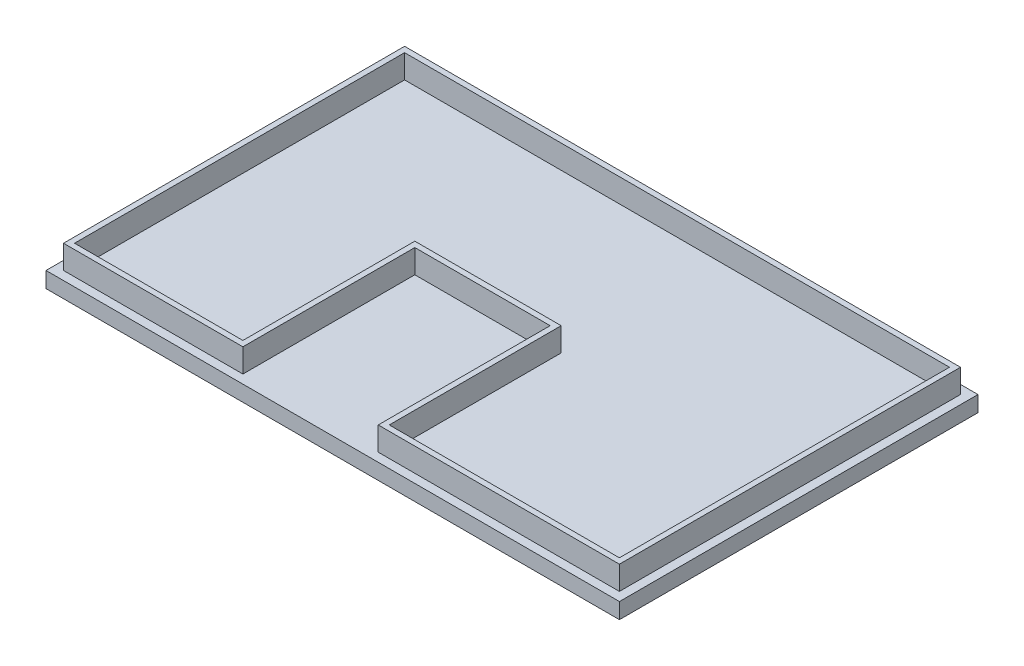
ISO-10303-21;
HEADER;
FILE_DESCRIPTION(('STEP AP214'),'2;1');
FILE_NAME('part.step','',(''),(''),'','','');
FILE_SCHEMA(('AUTOMOTIVE_DESIGN { 1 0 10303 214 1 1 1 1 }'));
ENDSEC;
DATA;
#1=APPLICATION_CONTEXT('core data for automotive mechanical design processes');
#2=APPLICATION_PROTOCOL_DEFINITION('international standard','automotive_design',2000,#1);
#3=PRODUCT_CONTEXT('',#1,'mechanical');
#4=PRODUCT('Part','Part','',(#3));
#5=PRODUCT_RELATED_PRODUCT_CATEGORY('part','',(#4));
#6=PRODUCT_DEFINITION_FORMATION('','',#4);
#7=PRODUCT_DEFINITION_CONTEXT('part definition',#1,'design');
#8=PRODUCT_DEFINITION('design','',#6,#7);
#9=PRODUCT_DEFINITION_SHAPE('','',#8);
#10=(LENGTH_UNIT() NAMED_UNIT(*) SI_UNIT(.MILLI.,.METRE.));
#11=(NAMED_UNIT(*) PLANE_ANGLE_UNIT() SI_UNIT($,.RADIAN.));
#12=(NAMED_UNIT(*) SI_UNIT($,.STERADIAN.) SOLID_ANGLE_UNIT());
#13=UNCERTAINTY_MEASURE_WITH_UNIT(LENGTH_MEASURE(1.E-05),#10,'distance_accuracy_value','');
#14=(GEOMETRIC_REPRESENTATION_CONTEXT(3) GLOBAL_UNCERTAINTY_ASSIGNED_CONTEXT((#13)) GLOBAL_UNIT_ASSIGNED_CONTEXT((#10,
#11,#12)) REPRESENTATION_CONTEXT('',''));
#15=CARTESIAN_POINT('',(0.,0.,0.));
#16=DIRECTION('',(0.,0.,1.));
#17=DIRECTION('',(1.,0.,0.));
#18=AXIS2_PLACEMENT_3D('',#15,#16,#17);
#19=CARTESIAN_POINT('',(0.,5.08,0.));
#20=DIRECTION('',(0.,1.,0.));
#21=DIRECTION('',(0.,0.,1.));
#22=AXIS2_PLACEMENT_3D('',#19,#20,#21);
#23=PLANE('',#22);
#24=DIRECTION('',(1.,0.,0.));
#25=VECTOR('',#24,1.);
#26=CARTESIAN_POINT('',(0.,5.08,0.));
#27=LINE('',#26,#25);
#28=CARTESIAN_POINT('',(0.,5.08,0.));
#29=VERTEX_POINT('',#28);
#30=CARTESIAN_POINT('',(185.1152,5.08,0.));
#31=VERTEX_POINT('',#30);
#32=EDGE_CURVE('E349',#29,#31,#27,.T.);
#33=ORIENTED_EDGE('',*,*,#32,.T.);
#34=DIRECTION('',(0.,0.,-1.));
#35=VECTOR('',#34,1.);
#36=CARTESIAN_POINT('',(185.1152,5.08,0.));
#37=LINE('',#36,#35);
#38=CARTESIAN_POINT('',(185.1152,5.08,-115.7478));
#39=VERTEX_POINT('',#38);
#40=EDGE_CURVE('E352',#31,#39,#37,.T.);
#41=ORIENTED_EDGE('',*,*,#40,.T.);
#42=DIRECTION('',(1.,0.,0.));
#43=VECTOR('',#42,1.);
#44=CARTESIAN_POINT('',(0.,5.08,-115.7478));
#45=LINE('',#44,#43);
#46=CARTESIAN_POINT('',(0.,5.08,-115.7478));
#47=VERTEX_POINT('',#46);
#48=EDGE_CURVE('E355',#47,#39,#45,.T.);
#49=ORIENTED_EDGE('',*,*,#48,.F.);
#50=DIRECTION('',(0.,0.,-1.));
#51=VECTOR('',#50,1.);
#52=CARTESIAN_POINT('',(0.,5.08,0.));
#53=LINE('',#52,#51);
#54=EDGE_CURVE('E358',#29,#47,#53,.T.);
#55=ORIENTED_EDGE('',*,*,#54,.F.);
#56=EDGE_LOOP('',(#33,#41,#49,#55));
#57=FACE_BOUND('',#56,.T.);
#58=DIRECTION('',(-1.,0.,0.));
#59=VECTOR('',#58,1.);
#60=CARTESIAN_POINT('',(60.7441,5.08,-2.8194));
#61=LINE('',#60,#59);
#62=CARTESIAN_POINT('',(60.7441,5.08,-2.8194));
#63=VERTEX_POINT('',#62);
#64=CARTESIAN_POINT('',(2.83209999999999,5.08,-2.81940000000001));
#65=VERTEX_POINT('',#64);
#66=EDGE_CURVE('E96',#63,#65,#61,.T.);
#67=ORIENTED_EDGE('',*,*,#66,.T.);
#68=DIRECTION('',(0.,0.,1.));
#69=VECTOR('',#68,1.);
#70=CARTESIAN_POINT('',(2.83209999999999,5.08,-112.9284));
#71=LINE('',#70,#69);
#72=CARTESIAN_POINT('',(2.83209999999999,5.08,-112.9284));
#73=VERTEX_POINT('',#72);
#74=EDGE_CURVE('E237',#73,#65,#71,.T.);
#75=ORIENTED_EDGE('',*,*,#74,.F.);
#76=DIRECTION('',(1.,0.,0.));
#77=VECTOR('',#76,1.);
#78=CARTESIAN_POINT('',(2.83209999999999,5.08,-112.9284));
#79=LINE('',#78,#77);
#80=CARTESIAN_POINT('',(182.2831,5.08,-112.9284));
#81=VERTEX_POINT('',#80);
#82=EDGE_CURVE('E292',#73,#81,#79,.T.);
#83=ORIENTED_EDGE('',*,*,#82,.T.);
#84=DIRECTION('',(0.,0.,1.));
#85=VECTOR('',#84,1.);
#86=CARTESIAN_POINT('',(182.2831,5.08,-112.9284));
#87=LINE('',#86,#85);
#88=CARTESIAN_POINT('',(182.2831,5.08,-2.81940000000004));
#89=VERTEX_POINT('',#88);
#90=EDGE_CURVE('E324',#81,#89,#87,.T.);
#91=ORIENTED_EDGE('',*,*,#90,.T.);
#92=DIRECTION('',(1.,0.,0.));
#93=VECTOR('',#92,1.);
#94=CARTESIAN_POINT('',(104.4321,5.08,-2.81940000000004));
#95=LINE('',#94,#93);
#96=CARTESIAN_POINT('',(104.4321,5.08,-2.81940000000004));
#97=VERTEX_POINT('',#96);
#98=EDGE_CURVE('E321',#97,#89,#95,.T.);
#99=ORIENTED_EDGE('',*,*,#98,.F.);
#100=DIRECTION('',(0.,0.,1.));
#101=VECTOR('',#100,1.);
#102=CARTESIAN_POINT('',(104.4321,5.08,-58.3184));
#103=LINE('',#102,#101);
#104=CARTESIAN_POINT('',(104.4321,5.08,-58.3184));
#105=VERTEX_POINT('',#104);
#106=EDGE_CURVE('E318',#105,#97,#103,.T.);
#107=ORIENTED_EDGE('',*,*,#106,.F.);
#108=DIRECTION('',(1.,0.,0.));
#109=VECTOR('',#108,1.);
#110=CARTESIAN_POINT('',(60.7441,5.08,-58.3184));
#111=LINE('',#110,#109);
#112=CARTESIAN_POINT('',(60.7441,5.08,-58.3184));
#113=VERTEX_POINT('',#112);
#114=EDGE_CURVE('E315',#113,#105,#111,.T.);
#115=ORIENTED_EDGE('',*,*,#114,.F.);
#116=DIRECTION('',(0.,0.,1.));
#117=VECTOR('',#116,1.);
#118=CARTESIAN_POINT('',(60.7441,5.08,-58.3184));
#119=LINE('',#118,#117);
#120=EDGE_CURVE('E101',#113,#63,#119,.T.);
#121=ORIENTED_EDGE('',*,*,#120,.T.);
#122=EDGE_LOOP('',(#67,#75,#83,#91,#99,#107,#115,#121));
#123=FACE_BOUND('',#122,.T.);
#124=ADVANCED_FACE('F81',(#57,#123),#23,.T.);
#125=CARTESIAN_POINT('',(0.,5.08,0.));
#126=DIRECTION('',(0.,0.,-1.));
#127=DIRECTION('',(-1.,0.,0.));
#128=AXIS2_PLACEMENT_3D('',#125,#126,#127);
#129=PLANE('',#128);
#130=DIRECTION('',(1.,0.,0.));
#131=VECTOR('',#130,1.);
#132=CARTESIAN_POINT('',(0.,0.,0.));
#133=LINE('',#132,#131);
#134=CARTESIAN_POINT('',(0.,0.,0.));
#135=VERTEX_POINT('',#134);
#136=CARTESIAN_POINT('',(185.1152,0.,0.));
#137=VERTEX_POINT('',#136);
#138=EDGE_CURVE('E348',#135,#137,#133,.T.);
#139=ORIENTED_EDGE('',*,*,#138,.T.);
#140=DIRECTION('',(0.,-1.,0.));
#141=VECTOR('',#140,1.);
#142=CARTESIAN_POINT('',(185.1152,5.08,0.));
#143=LINE('',#142,#141);
#144=EDGE_CURVE('E12',#31,#137,#143,.T.);
#145=ORIENTED_EDGE('',*,*,#144,.F.);
#146=ORIENTED_EDGE('',*,*,#32,.F.);
#147=DIRECTION('',(0.,-1.,0.));
#148=VECTOR('',#147,1.);
#149=CARTESIAN_POINT('',(0.,5.08,0.));
#150=LINE('',#149,#148);
#151=EDGE_CURVE('E361',#29,#135,#150,.T.);
#152=ORIENTED_EDGE('',*,*,#151,.T.);
#153=EDGE_LOOP('',(#139,#145,#146,#152));
#154=FACE_BOUND('',#153,.T.);
#155=ADVANCED_FACE('F83',(#154),#129,.F.);
#156=CARTESIAN_POINT('',(185.1152,5.08,0.));
#157=DIRECTION('',(-1.,0.,0.));
#158=DIRECTION('',(0.,0.,1.));
#159=AXIS2_PLACEMENT_3D('',#156,#157,#158);
#160=PLANE('',#159);
#161=DIRECTION('',(0.,0.,-1.));
#162=VECTOR('',#161,1.);
#163=CARTESIAN_POINT('',(185.1152,0.,0.));
#164=LINE('',#163,#162);
#165=CARTESIAN_POINT('',(185.1152,0.,-115.7478));
#166=VERTEX_POINT('',#165);
#167=EDGE_CURVE('E364',#137,#166,#164,.T.);
#168=ORIENTED_EDGE('',*,*,#167,.T.);
#169=DIRECTION('',(0.,-1.,0.));
#170=VECTOR('',#169,1.);
#171=CARTESIAN_POINT('',(185.1152,5.08,-115.7478));
#172=LINE('',#171,#170);
#173=EDGE_CURVE('E89',#39,#166,#172,.T.);
#174=ORIENTED_EDGE('',*,*,#173,.F.);
#175=ORIENTED_EDGE('',*,*,#40,.F.);
#176=ORIENTED_EDGE('',*,*,#144,.T.);
#177=EDGE_LOOP('',(#168,#174,#175,#176));
#178=FACE_BOUND('',#177,.T.);
#179=ADVANCED_FACE('F380',(#178),#160,.F.);
#180=CARTESIAN_POINT('',(0.,5.08,-115.7478));
#181=DIRECTION('',(0.,0.,-1.));
#182=DIRECTION('',(-1.,0.,0.));
#183=AXIS2_PLACEMENT_3D('',#180,#181,#182);
#184=PLANE('',#183);
#185=DIRECTION('',(1.,0.,0.));
#186=VECTOR('',#185,1.);
#187=CARTESIAN_POINT('',(0.,0.,-115.7478));
#188=LINE('',#187,#186);
#189=CARTESIAN_POINT('',(0.,0.,-115.7478));
#190=VERTEX_POINT('',#189);
#191=EDGE_CURVE('E367',#190,#166,#188,.T.);
#192=ORIENTED_EDGE('',*,*,#191,.F.);
#193=DIRECTION('',(0.,-1.,0.));
#194=VECTOR('',#193,1.);
#195=CARTESIAN_POINT('',(0.,5.08,-115.7478));
#196=LINE('',#195,#194);
#197=EDGE_CURVE('E373',#47,#190,#196,.T.);
#198=ORIENTED_EDGE('',*,*,#197,.F.);
#199=ORIENTED_EDGE('',*,*,#48,.T.);
#200=ORIENTED_EDGE('',*,*,#173,.T.);
#201=EDGE_LOOP('',(#192,#198,#199,#200));
#202=FACE_BOUND('',#201,.T.);
#203=ADVANCED_FACE('F377',(#202),#184,.T.);
#204=CARTESIAN_POINT('',(0.,5.08,0.));
#205=DIRECTION('',(-1.,0.,0.));
#206=DIRECTION('',(0.,0.,1.));
#207=AXIS2_PLACEMENT_3D('',#204,#205,#206);
#208=PLANE('',#207);
#209=DIRECTION('',(0.,0.,-1.));
#210=VECTOR('',#209,1.);
#211=CARTESIAN_POINT('',(0.,0.,0.));
#212=LINE('',#211,#210);
#213=EDGE_CURVE('E353',#135,#190,#212,.T.);
#214=ORIENTED_EDGE('',*,*,#213,.F.);
#215=ORIENTED_EDGE('',*,*,#151,.F.);
#216=ORIENTED_EDGE('',*,*,#54,.T.);
#217=ORIENTED_EDGE('',*,*,#197,.T.);
#218=EDGE_LOOP('',(#214,#215,#216,#217));
#219=FACE_BOUND('',#218,.T.);
#220=ADVANCED_FACE('F387',(#219),#208,.T.);
#221=CARTESIAN_POINT('',(0.,0.,0.));
#222=DIRECTION('',(0.,1.,0.));
#223=DIRECTION('',(0.,0.,1.));
#224=AXIS2_PLACEMENT_3D('',#221,#222,#223);
#225=PLANE('',#224);
#226=ORIENTED_EDGE('',*,*,#138,.F.);
#227=ORIENTED_EDGE('',*,*,#213,.T.);
#228=ORIENTED_EDGE('',*,*,#191,.T.);
#229=ORIENTED_EDGE('',*,*,#167,.F.);
#230=EDGE_LOOP('',(#226,#227,#228,#229));
#231=FACE_BOUND('',#230,.T.);
#232=ADVANCED_FACE('F384',(#231),#225,.F.);
#233=CARTESIAN_POINT('',(0.,12.7,0.));
#234=DIRECTION('',(0.,-1.,0.));
#235=DIRECTION('',(0.,0.,-1.));
#236=AXIS2_PLACEMENT_3D('',#233,#234,#235);
#237=PLANE('',#236);
#238=DIRECTION('',(0.,0.,1.));
#239=VECTOR('',#238,1.);
#240=CARTESIAN_POINT('',(2.83209999999999,12.7,-112.9284));
#241=LINE('',#240,#239);
#242=CARTESIAN_POINT('',(2.83209999999999,12.7,-112.9284));
#243=VERTEX_POINT('',#242);
#244=CARTESIAN_POINT('',(2.83209999999999,12.7,-2.81940000000001));
#245=VERTEX_POINT('',#244);
#246=EDGE_CURVE('E289',#243,#245,#241,.T.);
#247=ORIENTED_EDGE('',*,*,#246,.T.);
#248=DIRECTION('',(-1.,0.,0.));
#249=VECTOR('',#248,1.);
#250=CARTESIAN_POINT('',(60.7441,12.7,-2.8194));
#251=LINE('',#250,#249);
#252=CARTESIAN_POINT('',(60.7441,12.7,-2.8194));
#253=VERTEX_POINT('',#252);
#254=EDGE_CURVE('E291',#253,#245,#251,.T.);
#255=ORIENTED_EDGE('',*,*,#254,.F.);
#256=DIRECTION('',(0.,0.,1.));
#257=VECTOR('',#256,1.);
#258=CARTESIAN_POINT('',(60.7441,12.7,-58.3184));
#259=LINE('',#258,#257);
#260=CARTESIAN_POINT('',(60.7441,12.7,-58.3184));
#261=VERTEX_POINT('',#260);
#262=EDGE_CURVE('E295',#261,#253,#259,.T.);
#263=ORIENTED_EDGE('',*,*,#262,.F.);
#264=DIRECTION('',(1.,0.,0.));
#265=VECTOR('',#264,1.);
#266=CARTESIAN_POINT('',(60.7441,12.7,-58.3184));
#267=LINE('',#266,#265);
#268=CARTESIAN_POINT('',(104.4321,12.7,-58.3184));
#269=VERTEX_POINT('',#268);
#270=EDGE_CURVE('E298',#261,#269,#267,.T.);
#271=ORIENTED_EDGE('',*,*,#270,.T.);
#272=DIRECTION('',(0.,0.,1.));
#273=VECTOR('',#272,1.);
#274=CARTESIAN_POINT('',(104.4321,12.7,-58.3184));
#275=LINE('',#274,#273);
#276=CARTESIAN_POINT('',(104.4321,12.7,-2.81940000000004));
#277=VERTEX_POINT('',#276);
#278=EDGE_CURVE('E300',#269,#277,#275,.T.);
#279=ORIENTED_EDGE('',*,*,#278,.T.);
#280=DIRECTION('',(1.,0.,0.));
#281=VECTOR('',#280,1.);
#282=CARTESIAN_POINT('',(104.4321,12.7,-2.81940000000004));
#283=LINE('',#282,#281);
#284=CARTESIAN_POINT('',(182.2831,12.7,-2.81940000000004));
#285=VERTEX_POINT('',#284);
#286=EDGE_CURVE('E302',#277,#285,#283,.T.);
#287=ORIENTED_EDGE('',*,*,#286,.T.);
#288=DIRECTION('',(0.,0.,1.));
#289=VECTOR('',#288,1.);
#290=CARTESIAN_POINT('',(182.2831,12.7,-112.9284));
#291=LINE('',#290,#289);
#292=CARTESIAN_POINT('',(182.2831,12.7,-112.9284));
#293=VERTEX_POINT('',#292);
#294=EDGE_CURVE('E304',#293,#285,#291,.T.);
#295=ORIENTED_EDGE('',*,*,#294,.F.);
#296=DIRECTION('',(1.,0.,0.));
#297=VECTOR('',#296,1.);
#298=CARTESIAN_POINT('',(2.83209999999999,12.7,-112.9284));
#299=LINE('',#298,#297);
#300=EDGE_CURVE('E307',#243,#293,#299,.T.);
#301=ORIENTED_EDGE('',*,*,#300,.F.);
#302=EDGE_LOOP('',(#247,#255,#263,#271,#279,#287,#295,#301));
#303=FACE_BOUND('',#302,.T.);
#304=DIRECTION('',(-1.,0.,0.));
#305=VECTOR('',#304,1.);
#306=CARTESIAN_POINT('',(180.5051,12.7,-111.1504));
#307=LINE('',#306,#305);
#308=CARTESIAN_POINT('',(180.5051,12.7,-111.1504));
#309=VERTEX_POINT('',#308);
#310=CARTESIAN_POINT('',(4.61009999999998,12.7,-111.1504));
#311=VERTEX_POINT('',#310);
#312=EDGE_CURVE('E218',#309,#311,#307,.T.);
#313=ORIENTED_EDGE('',*,*,#312,.F.);
#314=DIRECTION('',(0.,0.,-1.));
#315=VECTOR('',#314,1.);
#316=CARTESIAN_POINT('',(180.5051,12.7,-4.59740000000004));
#317=LINE('',#316,#315);
#318=CARTESIAN_POINT('',(180.5051,12.7,-4.59740000000004));
#319=VERTEX_POINT('',#318);
#320=EDGE_CURVE('E256',#319,#309,#317,.T.);
#321=ORIENTED_EDGE('',*,*,#320,.F.);
#322=DIRECTION('',(1.,0.,0.));
#323=VECTOR('',#322,1.);
#324=CARTESIAN_POINT('',(106.2101,12.7,-4.59740000000004));
#325=LINE('',#324,#323);
#326=CARTESIAN_POINT('',(106.2101,12.7,-4.59740000000004));
#327=VERTEX_POINT('',#326);
#328=EDGE_CURVE('E253',#327,#319,#325,.T.);
#329=ORIENTED_EDGE('',*,*,#328,.F.);
#330=DIRECTION('',(0.,0.,1.));
#331=VECTOR('',#330,1.);
#332=CARTESIAN_POINT('',(106.2101,12.7,-60.0964));
#333=LINE('',#332,#331);
#334=CARTESIAN_POINT('',(106.2101,12.7,-60.0964));
#335=VERTEX_POINT('',#334);
#336=EDGE_CURVE('E251',#335,#327,#333,.T.);
#337=ORIENTED_EDGE('',*,*,#336,.F.);
#338=DIRECTION('',(1.,0.,0.));
#339=VECTOR('',#338,1.);
#340=CARTESIAN_POINT('',(58.9661,12.7,-60.0964));
#341=LINE('',#340,#339);
#342=CARTESIAN_POINT('',(58.9661,12.7,-60.0964));
#343=VERTEX_POINT('',#342);
#344=EDGE_CURVE('E249',#343,#335,#341,.T.);
#345=ORIENTED_EDGE('',*,*,#344,.F.);
#346=DIRECTION('',(0.,0.,-1.));
#347=VECTOR('',#346,1.);
#348=CARTESIAN_POINT('',(58.9661,12.7,-4.59739999999999));
#349=LINE('',#348,#347);
#350=CARTESIAN_POINT('',(58.9661,12.7,-4.59739999999999));
#351=VERTEX_POINT('',#350);
#352=EDGE_CURVE('E245',#351,#343,#349,.T.);
#353=ORIENTED_EDGE('',*,*,#352,.F.);
#354=DIRECTION('',(1.,0.,0.));
#355=VECTOR('',#354,1.);
#356=CARTESIAN_POINT('',(4.61009999999999,12.7,-4.59739999999999));
#357=LINE('',#356,#355);
#358=CARTESIAN_POINT('',(4.61009999999999,12.7,-4.59739999999999));
#359=VERTEX_POINT('',#358);
#360=EDGE_CURVE('E243',#359,#351,#357,.T.);
#361=ORIENTED_EDGE('',*,*,#360,.F.);
#362=DIRECTION('',(0.,0.,1.));
#363=VECTOR('',#362,1.);
#364=CARTESIAN_POINT('',(4.61009999999998,12.7,-111.1504));
#365=LINE('',#364,#363);
#366=EDGE_CURVE('E228',#311,#359,#365,.T.);
#367=ORIENTED_EDGE('',*,*,#366,.F.);
#368=EDGE_LOOP('',(#313,#321,#329,#337,#345,#353,#361,#367));
#369=FACE_BOUND('',#368,.T.);
#370=ADVANCED_FACE('F241',(#303,#369),#237,.F.);
#371=CARTESIAN_POINT('',(2.83209999999999,12.7,-112.9284));
#372=DIRECTION('',(1.,0.,0.));
#373=DIRECTION('',(0.,0.,-1.));
#374=AXIS2_PLACEMENT_3D('',#371,#372,#373);
#375=PLANE('',#374);
#376=ORIENTED_EDGE('',*,*,#74,.T.);
#377=DIRECTION('',(0.,-1.,0.));
#378=VECTOR('',#377,1.);
#379=CARTESIAN_POINT('',(2.83209999999999,12.7,-2.81940000000001));
#380=LINE('',#379,#378);
#381=EDGE_CURVE('E346',#245,#65,#380,.T.);
#382=ORIENTED_EDGE('',*,*,#381,.F.);
#383=ORIENTED_EDGE('',*,*,#246,.F.);
#384=DIRECTION('',(0.,-1.,0.));
#385=VECTOR('',#384,1.);
#386=CARTESIAN_POINT('',(2.83209999999999,12.7,-112.9284));
#387=LINE('',#386,#385);
#388=EDGE_CURVE('E310',#243,#73,#387,.T.);
#389=ORIENTED_EDGE('',*,*,#388,.T.);
#390=EDGE_LOOP('',(#376,#382,#383,#389));
#391=FACE_BOUND('',#390,.T.);
#392=ADVANCED_FACE('F449',(#391),#375,.F.);
#393=CARTESIAN_POINT('',(60.7441,12.7,-2.8194));
#394=DIRECTION('',(0.,0.,1.));
#395=DIRECTION('',(1.,0.,0.));
#396=AXIS2_PLACEMENT_3D('',#393,#394,#395);
#397=PLANE('',#396);
#398=ORIENTED_EDGE('',*,*,#66,.F.);
#399=DIRECTION('',(0.,-1.,0.));
#400=VECTOR('',#399,1.);
#401=CARTESIAN_POINT('',(60.7441,12.7,-2.8194));
#402=LINE('',#401,#400);
#403=EDGE_CURVE('E344',#253,#63,#402,.T.);
#404=ORIENTED_EDGE('',*,*,#403,.F.);
#405=ORIENTED_EDGE('',*,*,#254,.T.);
#406=ORIENTED_EDGE('',*,*,#381,.T.);
#407=EDGE_LOOP('',(#398,#404,#405,#406));
#408=FACE_BOUND('',#407,.T.);
#409=ADVANCED_FACE('F473',(#408),#397,.T.);
#410=CARTESIAN_POINT('',(60.7441,12.7,-58.3184));
#411=DIRECTION('',(1.,0.,0.));
#412=DIRECTION('',(0.,0.,-1.));
#413=AXIS2_PLACEMENT_3D('',#410,#411,#412);
#414=PLANE('',#413);
#415=ORIENTED_EDGE('',*,*,#120,.F.);
#416=DIRECTION('',(0.,-1.,0.));
#417=VECTOR('',#416,1.);
#418=CARTESIAN_POINT('',(60.7441,12.7,-58.3184));
#419=LINE('',#418,#417);
#420=EDGE_CURVE('E341',#261,#113,#419,.T.);
#421=ORIENTED_EDGE('',*,*,#420,.F.);
#422=ORIENTED_EDGE('',*,*,#262,.T.);
#423=ORIENTED_EDGE('',*,*,#403,.T.);
#424=EDGE_LOOP('',(#415,#421,#422,#423));
#425=FACE_BOUND('',#424,.T.);
#426=ADVANCED_FACE('F469',(#425),#414,.T.);
#427=CARTESIAN_POINT('',(60.7441,12.7,-58.3184));
#428=DIRECTION('',(0.,0.,-1.));
#429=DIRECTION('',(-1.,0.,0.));
#430=AXIS2_PLACEMENT_3D('',#427,#428,#429);
#431=PLANE('',#430);
#432=ORIENTED_EDGE('',*,*,#114,.T.);
#433=DIRECTION('',(0.,-1.,0.));
#434=VECTOR('',#433,1.);
#435=CARTESIAN_POINT('',(104.4321,12.7,-58.3184));
#436=LINE('',#435,#434);
#437=EDGE_CURVE('E338',#269,#105,#436,.T.);
#438=ORIENTED_EDGE('',*,*,#437,.F.);
#439=ORIENTED_EDGE('',*,*,#270,.F.);
#440=ORIENTED_EDGE('',*,*,#420,.T.);
#441=EDGE_LOOP('',(#432,#438,#439,#440));
#442=FACE_BOUND('',#441,.T.);
#443=ADVANCED_FACE('F465',(#442),#431,.F.);
#444=CARTESIAN_POINT('',(104.4321,12.7,-58.3184));
#445=DIRECTION('',(1.,0.,0.));
#446=DIRECTION('',(0.,0.,-1.));
#447=AXIS2_PLACEMENT_3D('',#444,#445,#446);
#448=PLANE('',#447);
#449=ORIENTED_EDGE('',*,*,#106,.T.);
#450=DIRECTION('',(0.,-1.,0.));
#451=VECTOR('',#450,1.);
#452=CARTESIAN_POINT('',(104.4321,12.7,-2.81940000000004));
#453=LINE('',#452,#451);
#454=EDGE_CURVE('E335',#277,#97,#453,.T.);
#455=ORIENTED_EDGE('',*,*,#454,.F.);
#456=ORIENTED_EDGE('',*,*,#278,.F.);
#457=ORIENTED_EDGE('',*,*,#437,.T.);
#458=EDGE_LOOP('',(#449,#455,#456,#457));
#459=FACE_BOUND('',#458,.T.);
#460=ADVANCED_FACE('F461',(#459),#448,.F.);
#461=CARTESIAN_POINT('',(104.4321,12.7,-2.81940000000004));
#462=DIRECTION('',(0.,0.,-1.));
#463=DIRECTION('',(-1.,0.,0.));
#464=AXIS2_PLACEMENT_3D('',#461,#462,#463);
#465=PLANE('',#464);
#466=ORIENTED_EDGE('',*,*,#98,.T.);
#467=DIRECTION('',(0.,-1.,0.));
#468=VECTOR('',#467,1.);
#469=CARTESIAN_POINT('',(182.2831,12.7,-2.81940000000004));
#470=LINE('',#469,#468);
#471=EDGE_CURVE('E332',#285,#89,#470,.T.);
#472=ORIENTED_EDGE('',*,*,#471,.F.);
#473=ORIENTED_EDGE('',*,*,#286,.F.);
#474=ORIENTED_EDGE('',*,*,#454,.T.);
#475=EDGE_LOOP('',(#466,#472,#473,#474));
#476=FACE_BOUND('',#475,.T.);
#477=ADVANCED_FACE('F457',(#476),#465,.F.);
#478=CARTESIAN_POINT('',(182.2831,12.7,-112.9284));
#479=DIRECTION('',(1.,0.,0.));
#480=DIRECTION('',(0.,0.,-1.));
#481=AXIS2_PLACEMENT_3D('',#478,#479,#480);
#482=PLANE('',#481);
#483=ORIENTED_EDGE('',*,*,#90,.F.);
#484=DIRECTION('',(0.,-1.,0.));
#485=VECTOR('',#484,1.);
#486=CARTESIAN_POINT('',(182.2831,12.7,-112.9284));
#487=LINE('',#486,#485);
#488=EDGE_CURVE('E329',#293,#81,#487,.T.);
#489=ORIENTED_EDGE('',*,*,#488,.F.);
#490=ORIENTED_EDGE('',*,*,#294,.T.);
#491=ORIENTED_EDGE('',*,*,#471,.T.);
#492=EDGE_LOOP('',(#483,#489,#490,#491));
#493=FACE_BOUND('',#492,.T.);
#494=ADVANCED_FACE('F453',(#493),#482,.T.);
#495=CARTESIAN_POINT('',(2.83209999999999,12.7,-112.9284));
#496=DIRECTION('',(0.,0.,-1.));
#497=DIRECTION('',(-1.,0.,0.));
#498=AXIS2_PLACEMENT_3D('',#495,#496,#497);
#499=PLANE('',#498);
#500=ORIENTED_EDGE('',*,*,#82,.F.);
#501=ORIENTED_EDGE('',*,*,#388,.F.);
#502=ORIENTED_EDGE('',*,*,#300,.T.);
#503=ORIENTED_EDGE('',*,*,#488,.T.);
#504=EDGE_LOOP('',(#500,#501,#502,#503));
#505=FACE_BOUND('',#504,.T.);
#506=ADVANCED_FACE('F446',(#505),#499,.T.);
#507=CARTESIAN_POINT('',(180.5051,12.7,-111.1504));
#508=DIRECTION('',(0.,0.,1.));
#509=DIRECTION('',(1.,0.,0.));
#510=AXIS2_PLACEMENT_3D('',#507,#508,#509);
#511=PLANE('',#510);
#512=DIRECTION('',(-1.,0.,0.));
#513=VECTOR('',#512,1.);
#514=CARTESIAN_POINT('',(180.5051,5.08,-111.1504));
#515=LINE('',#514,#513);
#516=CARTESIAN_POINT('',(180.5051,5.08,-111.1504));
#517=VERTEX_POINT('',#516);
#518=CARTESIAN_POINT('',(4.61009999999998,5.08,-111.1504));
#519=VERTEX_POINT('',#518);
#520=EDGE_CURVE('E258',#517,#519,#515,.T.);
#521=ORIENTED_EDGE('',*,*,#520,.F.);
#522=DIRECTION('',(0.,-1.,0.));
#523=VECTOR('',#522,1.);
#524=CARTESIAN_POINT('',(180.5051,12.7,-111.1504));
#525=LINE('',#524,#523);
#526=EDGE_CURVE('E224',#309,#517,#525,.T.);
#527=ORIENTED_EDGE('',*,*,#526,.F.);
#528=ORIENTED_EDGE('',*,*,#312,.T.);
#529=DIRECTION('',(0.,-1.,0.));
#530=VECTOR('',#529,1.);
#531=CARTESIAN_POINT('',(4.61009999999998,12.7,-111.1504));
#532=LINE('',#531,#530);
#533=EDGE_CURVE('E222',#311,#519,#532,.T.);
#534=ORIENTED_EDGE('',*,*,#533,.T.);
#535=EDGE_LOOP('',(#521,#527,#528,#534));
#536=FACE_BOUND('',#535,.T.);
#537=ADVANCED_FACE('F221',(#536),#511,.T.);
#538=CARTESIAN_POINT('',(4.61009999999998,12.7,-111.1504));
#539=DIRECTION('',(1.,0.,0.));
#540=DIRECTION('',(0.,0.,-1.));
#541=AXIS2_PLACEMENT_3D('',#538,#539,#540);
#542=PLANE('',#541);
#543=DIRECTION('',(0.,0.,1.));
#544=VECTOR('',#543,1.);
#545=CARTESIAN_POINT('',(4.61009999999998,5.08,-111.1504));
#546=LINE('',#545,#544);
#547=CARTESIAN_POINT('',(4.61009999999999,5.08,-4.59739999999999));
#548=VERTEX_POINT('',#547);
#549=EDGE_CURVE('E236',#519,#548,#546,.T.);
#550=ORIENTED_EDGE('',*,*,#549,.F.);
#551=ORIENTED_EDGE('',*,*,#533,.F.);
#552=ORIENTED_EDGE('',*,*,#366,.T.);
#553=DIRECTION('',(0.,-1.,0.));
#554=VECTOR('',#553,1.);
#555=CARTESIAN_POINT('',(4.61009999999999,12.7,-4.59739999999999));
#556=LINE('',#555,#554);
#557=EDGE_CURVE('E238',#359,#548,#556,.T.);
#558=ORIENTED_EDGE('',*,*,#557,.T.);
#559=EDGE_LOOP('',(#550,#551,#552,#558));
#560=FACE_BOUND('',#559,.T.);
#561=ADVANCED_FACE('F233',(#560),#542,.T.);
#562=CARTESIAN_POINT('',(4.61009999999999,12.7,-4.59739999999999));
#563=DIRECTION('',(0.,0.,-1.));
#564=DIRECTION('',(-1.,0.,0.));
#565=AXIS2_PLACEMENT_3D('',#562,#563,#564);
#566=PLANE('',#565);
#567=DIRECTION('',(1.,0.,0.));
#568=VECTOR('',#567,1.);
#569=CARTESIAN_POINT('',(4.61009999999999,5.08,-4.59739999999999));
#570=LINE('',#569,#568);
#571=CARTESIAN_POINT('',(58.9661,5.08,-4.59739999999999));
#572=VERTEX_POINT('',#571);
#573=EDGE_CURVE('E261',#548,#572,#570,.T.);
#574=ORIENTED_EDGE('',*,*,#573,.F.);
#575=ORIENTED_EDGE('',*,*,#557,.F.);
#576=ORIENTED_EDGE('',*,*,#360,.T.);
#577=DIRECTION('',(0.,-1.,0.));
#578=VECTOR('',#577,1.);
#579=CARTESIAN_POINT('',(58.9661,12.7,-4.59739999999999));
#580=LINE('',#579,#578);
#581=EDGE_CURVE('E285',#351,#572,#580,.T.);
#582=ORIENTED_EDGE('',*,*,#581,.T.);
#583=EDGE_LOOP('',(#574,#575,#576,#582));
#584=FACE_BOUND('',#583,.T.);
#585=ADVANCED_FACE('F433',(#584),#566,.T.);
#586=CARTESIAN_POINT('',(58.9661,12.7,-4.59739999999999));
#587=DIRECTION('',(-1.,0.,0.));
#588=DIRECTION('',(0.,0.,1.));
#589=AXIS2_PLACEMENT_3D('',#586,#587,#588);
#590=PLANE('',#589);
#591=DIRECTION('',(0.,0.,-1.));
#592=VECTOR('',#591,1.);
#593=CARTESIAN_POINT('',(58.9661,5.08,-4.59739999999999));
#594=LINE('',#593,#592);
#595=CARTESIAN_POINT('',(58.9661,5.08,-60.0964));
#596=VERTEX_POINT('',#595);
#597=EDGE_CURVE('E263',#572,#596,#594,.T.);
#598=ORIENTED_EDGE('',*,*,#597,.F.);
#599=ORIENTED_EDGE('',*,*,#581,.F.);
#600=ORIENTED_EDGE('',*,*,#352,.T.);
#601=DIRECTION('',(0.,-1.,0.));
#602=VECTOR('',#601,1.);
#603=CARTESIAN_POINT('',(58.9661,12.7,-60.0964));
#604=LINE('',#603,#602);
#605=EDGE_CURVE('E282',#343,#596,#604,.T.);
#606=ORIENTED_EDGE('',*,*,#605,.T.);
#607=EDGE_LOOP('',(#598,#599,#600,#606));
#608=FACE_BOUND('',#607,.T.);
#609=ADVANCED_FACE('F430',(#608),#590,.T.);
#610=CARTESIAN_POINT('',(58.9661,12.7,-60.0964));
#611=DIRECTION('',(0.,0.,-1.));
#612=DIRECTION('',(-1.,0.,0.));
#613=AXIS2_PLACEMENT_3D('',#610,#611,#612);
#614=PLANE('',#613);
#615=DIRECTION('',(1.,0.,0.));
#616=VECTOR('',#615,1.);
#617=CARTESIAN_POINT('',(58.9661,5.08,-60.0964));
#618=LINE('',#617,#616);
#619=CARTESIAN_POINT('',(106.2101,5.08,-60.0964));
#620=VERTEX_POINT('',#619);
#621=EDGE_CURVE('E265',#596,#620,#618,.T.);
#622=ORIENTED_EDGE('',*,*,#621,.F.);
#623=ORIENTED_EDGE('',*,*,#605,.F.);
#624=ORIENTED_EDGE('',*,*,#344,.T.);
#625=DIRECTION('',(0.,-1.,0.));
#626=VECTOR('',#625,1.);
#627=CARTESIAN_POINT('',(106.2101,12.7,-60.0964));
#628=LINE('',#627,#626);
#629=EDGE_CURVE('E279',#335,#620,#628,.T.);
#630=ORIENTED_EDGE('',*,*,#629,.T.);
#631=EDGE_LOOP('',(#622,#623,#624,#630));
#632=FACE_BOUND('',#631,.T.);
#633=ADVANCED_FACE('F425',(#632),#614,.T.);
#634=CARTESIAN_POINT('',(106.2101,12.7,-60.0964));
#635=DIRECTION('',(1.,0.,0.));
#636=DIRECTION('',(0.,0.,-1.));
#637=AXIS2_PLACEMENT_3D('',#634,#635,#636);
#638=PLANE('',#637);
#639=DIRECTION('',(0.,0.,1.));
#640=VECTOR('',#639,1.);
#641=CARTESIAN_POINT('',(106.2101,5.08,-60.0964));
#642=LINE('',#641,#640);
#643=CARTESIAN_POINT('',(106.2101,5.08,-4.59740000000004));
#644=VERTEX_POINT('',#643);
#645=EDGE_CURVE('E267',#620,#644,#642,.T.);
#646=ORIENTED_EDGE('',*,*,#645,.F.);
#647=ORIENTED_EDGE('',*,*,#629,.F.);
#648=ORIENTED_EDGE('',*,*,#336,.T.);
#649=DIRECTION('',(0.,-1.,0.));
#650=VECTOR('',#649,1.);
#651=CARTESIAN_POINT('',(106.2101,12.7,-4.59740000000004));
#652=LINE('',#651,#650);
#653=EDGE_CURVE('E276',#327,#644,#652,.T.);
#654=ORIENTED_EDGE('',*,*,#653,.T.);
#655=EDGE_LOOP('',(#646,#647,#648,#654));
#656=FACE_BOUND('',#655,.T.);
#657=ADVANCED_FACE('F421',(#656),#638,.T.);
#658=CARTESIAN_POINT('',(106.2101,12.7,-4.59740000000004));
#659=DIRECTION('',(0.,0.,-1.));
#660=DIRECTION('',(-1.,0.,0.));
#661=AXIS2_PLACEMENT_3D('',#658,#659,#660);
#662=PLANE('',#661);
#663=DIRECTION('',(1.,0.,0.));
#664=VECTOR('',#663,1.);
#665=CARTESIAN_POINT('',(106.2101,5.08,-4.59740000000004));
#666=LINE('',#665,#664);
#667=CARTESIAN_POINT('',(180.5051,5.08,-4.59740000000004));
#668=VERTEX_POINT('',#667);
#669=EDGE_CURVE('E269',#644,#668,#666,.T.);
#670=ORIENTED_EDGE('',*,*,#669,.F.);
#671=ORIENTED_EDGE('',*,*,#653,.F.);
#672=ORIENTED_EDGE('',*,*,#328,.T.);
#673=DIRECTION('',(0.,-1.,0.));
#674=VECTOR('',#673,1.);
#675=CARTESIAN_POINT('',(180.5051,12.7,-4.59740000000004));
#676=LINE('',#675,#674);
#677=EDGE_CURVE('E273',#319,#668,#676,.T.);
#678=ORIENTED_EDGE('',*,*,#677,.T.);
#679=EDGE_LOOP('',(#670,#671,#672,#678));
#680=FACE_BOUND('',#679,.T.);
#681=ADVANCED_FACE('F409',(#680),#662,.T.);
#682=CARTESIAN_POINT('',(180.5051,12.7,-4.59740000000004));
#683=DIRECTION('',(-1.,0.,0.));
#684=DIRECTION('',(0.,0.,1.));
#685=AXIS2_PLACEMENT_3D('',#682,#683,#684);
#686=PLANE('',#685);
#687=DIRECTION('',(0.,0.,-1.));
#688=VECTOR('',#687,1.);
#689=CARTESIAN_POINT('',(180.5051,5.08,-4.59740000000004));
#690=LINE('',#689,#688);
#691=EDGE_CURVE('E229',#668,#517,#690,.T.);
#692=ORIENTED_EDGE('',*,*,#691,.F.);
#693=ORIENTED_EDGE('',*,*,#677,.F.);
#694=ORIENTED_EDGE('',*,*,#320,.T.);
#695=ORIENTED_EDGE('',*,*,#526,.T.);
#696=EDGE_LOOP('',(#692,#693,#694,#695));
#697=FACE_BOUND('',#696,.T.);
#698=ADVANCED_FACE('F404',(#697),#686,.T.);
#699=ORIENTED_EDGE('',*,*,#520,.T.);
#700=ORIENTED_EDGE('',*,*,#549,.T.);
#701=ORIENTED_EDGE('',*,*,#573,.T.);
#702=ORIENTED_EDGE('',*,*,#597,.T.);
#703=ORIENTED_EDGE('',*,*,#621,.T.);
#704=ORIENTED_EDGE('',*,*,#645,.T.);
#705=ORIENTED_EDGE('',*,*,#669,.T.);
#706=ORIENTED_EDGE('',*,*,#691,.T.);
#707=EDGE_LOOP('',(#699,#700,#701,#702,#703,#704,#705,#706));
#708=FACE_BOUND('',#707,.T.);
#709=ADVANCED_FACE('F398',(#708),#23,.T.);
#710=CLOSED_SHELL('',(#124,#155,#179,#203,#220,#232,#370,#392,#409,#426,#443,#460,#477,#494,
#506,#537,#561,#585,#609,#633,#657,#681,#698,#709));
#711=MANIFOLD_SOLID_BREP('B2',#710);
#712=ADVANCED_BREP_SHAPE_REPRESENTATION('',(#18,#711),#14);
#713=SHAPE_DEFINITION_REPRESENTATION(#9,#712);
ENDSEC;
END-ISO-10303-21;
